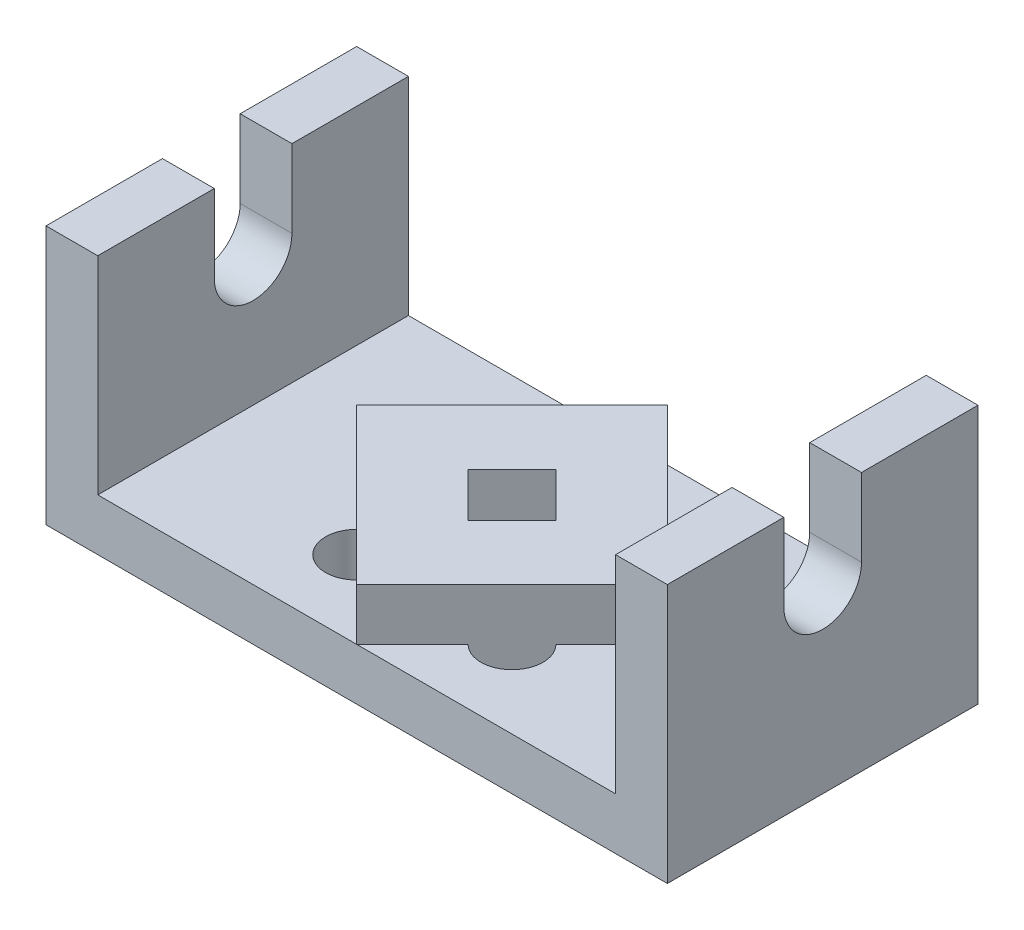
ISO-10303-21;
HEADER;
FILE_DESCRIPTION(('STEP AP214'),'2;1');
FILE_NAME('part.step','',(''),(''),'','','');
FILE_SCHEMA(('AUTOMOTIVE_DESIGN { 1 0 10303 214 1 1 1 1 }'));
ENDSEC;
DATA;
#1=APPLICATION_CONTEXT('core data for automotive mechanical design processes');
#2=APPLICATION_PROTOCOL_DEFINITION('international standard','automotive_design',2000,#1);
#3=PRODUCT_CONTEXT('',#1,'mechanical');
#4=PRODUCT('Part','Part','',(#3));
#5=PRODUCT_RELATED_PRODUCT_CATEGORY('part','',(#4));
#6=PRODUCT_DEFINITION_FORMATION('','',#4);
#7=PRODUCT_DEFINITION_CONTEXT('part definition',#1,'design');
#8=PRODUCT_DEFINITION('design','',#6,#7);
#9=PRODUCT_DEFINITION_SHAPE('','',#8);
#10=(LENGTH_UNIT() NAMED_UNIT(*) SI_UNIT(.MILLI.,.METRE.));
#11=(NAMED_UNIT(*) PLANE_ANGLE_UNIT() SI_UNIT($,.RADIAN.));
#12=(NAMED_UNIT(*) SI_UNIT($,.STERADIAN.) SOLID_ANGLE_UNIT());
#13=UNCERTAINTY_MEASURE_WITH_UNIT(LENGTH_MEASURE(1.E-05),#10,'distance_accuracy_value','');
#14=(GEOMETRIC_REPRESENTATION_CONTEXT(3) GLOBAL_UNCERTAINTY_ASSIGNED_CONTEXT((#13)) GLOBAL_UNIT_ASSIGNED_CONTEXT((#10,
#11,#12)) REPRESENTATION_CONTEXT('',''));
#15=CARTESIAN_POINT('',(0.,0.,0.));
#16=DIRECTION('',(0.,0.,1.));
#17=DIRECTION('',(1.,0.,0.));
#18=AXIS2_PLACEMENT_3D('',#15,#16,#17);
#19=CARTESIAN_POINT('',(50.,10.,30.));
#20=DIRECTION('',(0.,-1.,0.));
#21=DIRECTION('',(1.,0.,0.));
#22=AXIS2_PLACEMENT_3D('',#19,#20,#21);
#23=PLANE('',#22);
#24=DIRECTION('',(-0.707106781186548,0.,-0.707106781186547));
#25=VECTOR('',#24,1.);
#26=CARTESIAN_POINT('',(0.,10.,30.));
#27=LINE('',#26,#25);
#28=CARTESIAN_POINT('',(0.,10.,30.));
#29=VERTEX_POINT('',#28);
#30=CARTESIAN_POINT('',(-10.7573593128807,10.,19.2426406871193));
#31=VERTEX_POINT('',#30);
#32=EDGE_CURVE('E342',#29,#31,#27,.T.);
#33=ORIENTED_EDGE('',*,*,#32,.T.);
#34=CARTESIAN_POINT('',(-15.0000000000013,10.,15.0000000000012));
#35=DIRECTION('',(0.,-1.,0.));
#36=DIRECTION('',(1.,0.,0.));
#37=AXIS2_PLACEMENT_3D('',#34,#35,#36);
#38=CIRCLE('',#37,6.);
#39=CARTESIAN_POINT('',(-19.2426406871206,10.,10.7573593128819));
#40=VERTEX_POINT('',#39);
#41=EDGE_CURVE('E282',#31,#40,#38,.T.);
#42=ORIENTED_EDGE('',*,*,#41,.T.);
#43=CARTESIAN_POINT('',(-30.,10.,0.));
#44=VERTEX_POINT('',#43);
#45=EDGE_CURVE('E325',#40,#44,#27,.T.);
#46=ORIENTED_EDGE('',*,*,#45,.T.);
#47=DIRECTION('',(0.707106781186547,0.,-0.707106781186547));
#48=VECTOR('',#47,1.);
#49=CARTESIAN_POINT('',(-30.,10.,0.));
#50=LINE('',#49,#48);
#51=CARTESIAN_POINT('',(-19.2426406871199,10.,-10.7573593128801));
#52=VERTEX_POINT('',#51);
#53=EDGE_CURVE('E346',#44,#52,#50,.T.);
#54=ORIENTED_EDGE('',*,*,#53,.T.);
#55=CARTESIAN_POINT('',(-15.0000000000013,10.,-15.));
#56=DIRECTION('',(0.,-1.,0.));
#57=DIRECTION('',(1.,0.,0.));
#58=AXIS2_PLACEMENT_3D('',#55,#56,#57);
#59=CIRCLE('',#58,6.);
#60=CARTESIAN_POINT('',(-10.757359312882,10.,-19.2426406871193));
#61=VERTEX_POINT('',#60);
#62=EDGE_CURVE('E263',#52,#61,#59,.T.);
#63=ORIENTED_EDGE('',*,*,#62,.T.);
#64=CARTESIAN_POINT('',(0.,10.,-30.));
#65=VERTEX_POINT('',#64);
#66=EDGE_CURVE('E345',#61,#65,#50,.T.);
#67=ORIENTED_EDGE('',*,*,#66,.T.);
#68=DIRECTION('',(-1.,0.,0.));
#69=VECTOR('',#68,1.);
#70=CARTESIAN_POINT('',(50.,10.,-30.));
#71=LINE('',#70,#69);
#72=CARTESIAN_POINT('',(-50.,10.,-30.));
#73=VERTEX_POINT('',#72);
#74=EDGE_CURVE('E446',#65,#73,#71,.T.);
#75=ORIENTED_EDGE('',*,*,#74,.T.);
#76=DIRECTION('',(0.,0.,-1.));
#77=VECTOR('',#76,1.);
#78=CARTESIAN_POINT('',(-50.,10.,30.));
#79=LINE('',#78,#77);
#80=CARTESIAN_POINT('',(-50.,10.,30.));
#81=VERTEX_POINT('',#80);
#82=EDGE_CURVE('E428',#81,#73,#79,.T.);
#83=ORIENTED_EDGE('',*,*,#82,.F.);
#84=DIRECTION('',(-1.,0.,0.));
#85=VECTOR('',#84,1.);
#86=CARTESIAN_POINT('',(50.,10.,30.));
#87=LINE('',#86,#85);
#88=EDGE_CURVE('E424',#29,#81,#87,.T.);
#89=ORIENTED_EDGE('',*,*,#88,.F.);
#90=EDGE_LOOP('',(#33,#42,#46,#54,#63,#67,#75,#83,#89));
#91=FACE_BOUND('',#90,.T.);
#92=ADVANCED_FACE('F33',(#91),#23,.F.);
#93=CARTESIAN_POINT('',(-60.,50.,30.));
#94=DIRECTION('',(0.,-1.,0.));
#95=DIRECTION('',(0.,0.,-1.));
#96=AXIS2_PLACEMENT_3D('',#93,#94,#95);
#97=PLANE('',#96);
#98=DIRECTION('',(0.,0.,-1.));
#99=VECTOR('',#98,1.);
#100=CARTESIAN_POINT('',(-50.,50.,30.));
#101=LINE('',#100,#99);
#102=CARTESIAN_POINT('',(-50.,50.,30.));
#103=VERTEX_POINT('',#102);
#104=CARTESIAN_POINT('',(-50.,50.,7.5));
#105=VERTEX_POINT('',#104);
#106=EDGE_CURVE('E473',#103,#105,#101,.T.);
#107=ORIENTED_EDGE('',*,*,#106,.T.);
#108=DIRECTION('',(1.,0.,0.));
#109=VECTOR('',#108,1.);
#110=CARTESIAN_POINT('',(-60.,50.,7.5));
#111=LINE('',#110,#109);
#112=CARTESIAN_POINT('',(-60.,50.,7.5));
#113=VERTEX_POINT('',#112);
#114=EDGE_CURVE('E389',#113,#105,#111,.T.);
#115=ORIENTED_EDGE('',*,*,#114,.F.);
#116=DIRECTION('',(0.,0.,-1.));
#117=VECTOR('',#116,1.);
#118=CARTESIAN_POINT('',(-60.,50.,30.));
#119=LINE('',#118,#117);
#120=CARTESIAN_POINT('',(-60.,50.,30.));
#121=VERTEX_POINT('',#120);
#122=EDGE_CURVE('E469',#121,#113,#119,.T.);
#123=ORIENTED_EDGE('',*,*,#122,.F.);
#124=DIRECTION('',(-1.,0.,0.));
#125=VECTOR('',#124,1.);
#126=CARTESIAN_POINT('',(-60.,50.,30.));
#127=LINE('',#126,#125);
#128=EDGE_CURVE('E411',#103,#121,#127,.T.);
#129=ORIENTED_EDGE('',*,*,#128,.F.);
#130=EDGE_LOOP('',(#107,#115,#123,#129));
#131=FACE_BOUND('',#130,.T.);
#132=ADVANCED_FACE('F569',(#131),#97,.F.);
#133=CARTESIAN_POINT('',(60.,50.,30.));
#134=DIRECTION('',(0.,-1.,0.));
#135=DIRECTION('',(0.,0.,-1.));
#136=AXIS2_PLACEMENT_3D('',#133,#134,#135);
#137=PLANE('',#136);
#138=DIRECTION('',(0.,0.,-1.));
#139=VECTOR('',#138,1.);
#140=CARTESIAN_POINT('',(60.,50.,30.));
#141=LINE('',#140,#139);
#142=CARTESIAN_POINT('',(60.,50.,30.));
#143=VERTEX_POINT('',#142);
#144=CARTESIAN_POINT('',(60.,50.,7.5));
#145=VERTEX_POINT('',#144);
#146=EDGE_CURVE('E459',#143,#145,#141,.T.);
#147=ORIENTED_EDGE('',*,*,#146,.T.);
#148=CARTESIAN_POINT('',(50.,50.,7.5));
#149=VERTEX_POINT('',#148);
#150=EDGE_CURVE('E391',#149,#145,#111,.T.);
#151=ORIENTED_EDGE('',*,*,#150,.F.);
#152=DIRECTION('',(0.,0.,-1.));
#153=VECTOR('',#152,1.);
#154=CARTESIAN_POINT('',(50.,50.,30.));
#155=LINE('',#154,#153);
#156=CARTESIAN_POINT('',(50.,50.,30.));
#157=VERTEX_POINT('',#156);
#158=EDGE_CURVE('E455',#157,#149,#155,.T.);
#159=ORIENTED_EDGE('',*,*,#158,.F.);
#160=DIRECTION('',(-1.,0.,0.));
#161=VECTOR('',#160,1.);
#162=CARTESIAN_POINT('',(60.,50.,30.));
#163=LINE('',#162,#161);
#164=EDGE_CURVE('E420',#143,#157,#163,.T.);
#165=ORIENTED_EDGE('',*,*,#164,.F.);
#166=EDGE_LOOP('',(#147,#151,#159,#165));
#167=FACE_BOUND('',#166,.T.);
#168=ADVANCED_FACE('F571',(#167),#137,.F.);
#169=CARTESIAN_POINT('',(-50.,50.,30.));
#170=DIRECTION('',(-1.,0.,0.));
#171=DIRECTION('',(0.,-1.,0.));
#172=AXIS2_PLACEMENT_3D('',#169,#170,#171);
#173=PLANE('',#172);
#174=CARTESIAN_POINT('',(-50.,35.,0.));
#175=DIRECTION('',(-1.,0.,0.));
#176=DIRECTION('',(0.,-1.,0.));
#177=AXIS2_PLACEMENT_3D('',#174,#175,#176);
#178=CIRCLE('',#177,7.5);
#179=CARTESIAN_POINT('',(-50.,35.,-7.5));
#180=VERTEX_POINT('',#179);
#181=CARTESIAN_POINT('',(-50.,35.,7.5));
#182=VERTEX_POINT('',#181);
#183=EDGE_CURVE('E404',#180,#182,#178,.T.);
#184=ORIENTED_EDGE('',*,*,#183,.T.);
#185=DIRECTION('',(0.,1.,0.));
#186=VECTOR('',#185,1.);
#187=CARTESIAN_POINT('',(-50.,50.,7.5));
#188=LINE('',#187,#186);
#189=EDGE_CURVE('E401',#182,#105,#188,.T.);
#190=ORIENTED_EDGE('',*,*,#189,.T.);
#191=ORIENTED_EDGE('',*,*,#106,.F.);
#192=DIRECTION('',(0.,1.,0.));
#193=VECTOR('',#192,1.);
#194=CARTESIAN_POINT('',(-50.,50.,30.));
#195=LINE('',#194,#193);
#196=EDGE_CURVE('E408',#81,#103,#195,.T.);
#197=ORIENTED_EDGE('',*,*,#196,.F.);
#198=ORIENTED_EDGE('',*,*,#82,.T.);
#199=DIRECTION('',(0.,1.,0.));
#200=VECTOR('',#199,1.);
#201=CARTESIAN_POINT('',(-50.,50.,-30.));
#202=LINE('',#201,#200);
#203=CARTESIAN_POINT('',(-50.,50.,-30.));
#204=VERTEX_POINT('',#203);
#205=EDGE_CURVE('E407',#73,#204,#202,.T.);
#206=ORIENTED_EDGE('',*,*,#205,.T.);
#207=CARTESIAN_POINT('',(-50.,50.,-7.5));
#208=VERTEX_POINT('',#207);
#209=EDGE_CURVE('E472',#208,#204,#101,.T.);
#210=ORIENTED_EDGE('',*,*,#209,.F.);
#211=DIRECTION('',(0.,-1.,0.));
#212=VECTOR('',#211,1.);
#213=CARTESIAN_POINT('',(-50.,50.,-7.5));
#214=LINE('',#213,#212);
#215=EDGE_CURVE('E387',#208,#180,#214,.T.);
#216=ORIENTED_EDGE('',*,*,#215,.T.);
#217=EDGE_LOOP('',(#184,#190,#191,#197,#198,#206,#210,#216));
#218=FACE_BOUND('',#217,.T.);
#219=ADVANCED_FACE('F35',(#218),#173,.F.);
#220=CARTESIAN_POINT('',(-60.,50.,-7.5));
#221=VERTEX_POINT('',#220);
#222=CARTESIAN_POINT('',(-60.,50.,-30.));
#223=VERTEX_POINT('',#222);
#224=EDGE_CURVE('E468',#221,#223,#119,.T.);
#225=ORIENTED_EDGE('',*,*,#224,.F.);
#226=DIRECTION('',(1.,0.,0.));
#227=VECTOR('',#226,1.);
#228=CARTESIAN_POINT('',(-60.,50.,-7.5));
#229=LINE('',#228,#227);
#230=EDGE_CURVE('E392',#221,#208,#229,.T.);
#231=ORIENTED_EDGE('',*,*,#230,.T.);
#232=ORIENTED_EDGE('',*,*,#209,.T.);
#233=DIRECTION('',(-1.,0.,0.));
#234=VECTOR('',#233,1.);
#235=CARTESIAN_POINT('',(-60.,50.,-30.));
#236=LINE('',#235,#234);
#237=EDGE_CURVE('E431',#204,#223,#236,.T.);
#238=ORIENTED_EDGE('',*,*,#237,.T.);
#239=EDGE_LOOP('',(#225,#231,#232,#238));
#240=FACE_BOUND('',#239,.T.);
#241=ADVANCED_FACE('F558',(#240),#97,.F.);
#242=CARTESIAN_POINT('',(-60.,0.,30.));
#243=DIRECTION('',(1.,0.,0.));
#244=DIRECTION('',(0.,0.,-1.));
#245=AXIS2_PLACEMENT_3D('',#242,#243,#244);
#246=PLANE('',#245);
#247=ORIENTED_EDGE('',*,*,#122,.T.);
#248=DIRECTION('',(0.,-1.,0.));
#249=VECTOR('',#248,1.);
#250=CARTESIAN_POINT('',(-60.,35.,7.5));
#251=LINE('',#250,#249);
#252=CARTESIAN_POINT('',(-60.,35.,7.5));
#253=VERTEX_POINT('',#252);
#254=EDGE_CURVE('E374',#113,#253,#251,.T.);
#255=ORIENTED_EDGE('',*,*,#254,.T.);
#256=CARTESIAN_POINT('',(-60.,35.,0.));
#257=DIRECTION('',(1.,0.,0.));
#258=DIRECTION('',(0.,0.,-1.));
#259=AXIS2_PLACEMENT_3D('',#256,#257,#258);
#260=CIRCLE('',#259,7.5);
#261=CARTESIAN_POINT('',(-60.,35.,-7.5));
#262=VERTEX_POINT('',#261);
#263=EDGE_CURVE('E367',#253,#262,#260,.T.);
#264=ORIENTED_EDGE('',*,*,#263,.T.);
#265=DIRECTION('',(0.,1.,0.));
#266=VECTOR('',#265,1.);
#267=CARTESIAN_POINT('',(-60.,35.,-7.5));
#268=LINE('',#267,#266);
#269=EDGE_CURVE('E370',#262,#221,#268,.T.);
#270=ORIENTED_EDGE('',*,*,#269,.T.);
#271=ORIENTED_EDGE('',*,*,#224,.T.);
#272=DIRECTION('',(0.,-1.,0.));
#273=VECTOR('',#272,1.);
#274=CARTESIAN_POINT('',(-60.,0.,-30.));
#275=LINE('',#274,#273);
#276=CARTESIAN_POINT('',(-60.,0.,-30.));
#277=VERTEX_POINT('',#276);
#278=EDGE_CURVE('E434',#223,#277,#275,.T.);
#279=ORIENTED_EDGE('',*,*,#278,.T.);
#280=DIRECTION('',(0.,0.,-1.));
#281=VECTOR('',#280,1.);
#282=CARTESIAN_POINT('',(-60.,0.,30.));
#283=LINE('',#282,#281);
#284=CARTESIAN_POINT('',(-60.,0.,30.));
#285=VERTEX_POINT('',#284);
#286=EDGE_CURVE('E465',#285,#277,#283,.T.);
#287=ORIENTED_EDGE('',*,*,#286,.F.);
#288=DIRECTION('',(0.,-1.,0.));
#289=VECTOR('',#288,1.);
#290=CARTESIAN_POINT('',(-60.,0.,30.));
#291=LINE('',#290,#289);
#292=EDGE_CURVE('E414',#121,#285,#291,.T.);
#293=ORIENTED_EDGE('',*,*,#292,.F.);
#294=EDGE_LOOP('',(#247,#255,#264,#270,#271,#279,#287,#293));
#295=FACE_BOUND('',#294,.T.);
#296=ADVANCED_FACE('F537',(#295),#246,.F.);
#297=CARTESIAN_POINT('',(-60.,0.,30.));
#298=DIRECTION('',(0.,1.,0.));
#299=DIRECTION('',(-1.,0.,0.));
#300=AXIS2_PLACEMENT_3D('',#297,#298,#299);
#301=PLANE('',#300);
#302=DIRECTION('',(-0.707106781186547,0.,0.707106781186548));
#303=VECTOR('',#302,1.);
#304=CARTESIAN_POINT('',(19.2426406871193,0.,10.757359312882));
#305=LINE('',#304,#303);
#306=CARTESIAN_POINT('',(19.2426406871193,0.,10.757359312882));
#307=VERTEX_POINT('',#306);
#308=CARTESIAN_POINT('',(10.7573593128807,0.,19.2426406871205));
#309=VERTEX_POINT('',#308);
#310=EDGE_CURVE('E249',#307,#309,#305,.T.);
#311=ORIENTED_EDGE('',*,*,#310,.T.);
#312=CARTESIAN_POINT('',(15.,0.,15.0000000000013));
#313=DIRECTION('',(0.,1.,0.));
#314=DIRECTION('',(-1.,0.,0.));
#315=AXIS2_PLACEMENT_3D('',#312,#313,#314);
#316=CIRCLE('',#315,6.);
#317=EDGE_CURVE('E48',#309,#307,#316,.T.);
#318=ORIENTED_EDGE('',*,*,#317,.T.);
#319=EDGE_LOOP('',(#311,#318));
#320=FACE_BOUND('',#319,.T.);
#321=DIRECTION('',(-0.707106781186548,0.,-0.707106781186547));
#322=VECTOR('',#321,1.);
#323=CARTESIAN_POINT('',(-10.757359312882,0.,19.2426406871205));
#324=LINE('',#323,#322);
#325=CARTESIAN_POINT('',(-10.757359312882,0.,19.2426406871205));
#326=VERTEX_POINT('',#325);
#327=CARTESIAN_POINT('',(-19.2426406871206,0.,10.7573593128819));
#328=VERTEX_POINT('',#327);
#329=EDGE_CURVE('E266',#326,#328,#324,.T.);
#330=ORIENTED_EDGE('',*,*,#329,.T.);
#331=CARTESIAN_POINT('',(-15.0000000000013,0.,15.0000000000012));
#332=DIRECTION('',(0.,1.,0.));
#333=DIRECTION('',(-1.,0.,0.));
#334=AXIS2_PLACEMENT_3D('',#331,#332,#333);
#335=CIRCLE('',#334,6.);
#336=EDGE_CURVE('E56',#328,#326,#335,.T.);
#337=ORIENTED_EDGE('',*,*,#336,.T.);
#338=EDGE_LOOP('',(#330,#337));
#339=FACE_BOUND('',#338,.T.);
#340=DIRECTION('',(0.707106781186547,0.,-0.707106781186548));
#341=VECTOR('',#340,1.);
#342=CARTESIAN_POINT('',(-19.2426406871205,0.,-10.7573593128807));
#343=LINE('',#342,#341);
#344=CARTESIAN_POINT('',(-19.2426406871205,0.,-10.7573593128807));
#345=VERTEX_POINT('',#344);
#346=CARTESIAN_POINT('',(-10.757359312882,0.,-19.2426406871193));
#347=VERTEX_POINT('',#346);
#348=EDGE_CURVE('E274',#345,#347,#343,.T.);
#349=ORIENTED_EDGE('',*,*,#348,.T.);
#350=CARTESIAN_POINT('',(-15.0000000000013,0.,-15.));
#351=DIRECTION('',(0.,1.,0.));
#352=DIRECTION('',(-1.,0.,0.));
#353=AXIS2_PLACEMENT_3D('',#350,#351,#352);
#354=CIRCLE('',#353,6.);
#355=EDGE_CURVE('E271',#347,#345,#354,.T.);
#356=ORIENTED_EDGE('',*,*,#355,.T.);
#357=EDGE_LOOP('',(#349,#356));
#358=FACE_BOUND('',#357,.T.);
#359=DIRECTION('',(0.707106781186547,0.,0.707106781186547));
#360=VECTOR('',#359,1.);
#361=CARTESIAN_POINT('',(10.7573593128807,0.,-19.2426406871193));
#362=LINE('',#361,#360);
#363=CARTESIAN_POINT('',(10.7573593128807,0.,-19.2426406871193));
#364=VERTEX_POINT('',#363);
#365=CARTESIAN_POINT('',(19.2426406871193,0.,-10.7573593128807));
#366=VERTEX_POINT('',#365);
#367=EDGE_CURVE('E289',#364,#366,#362,.T.);
#368=ORIENTED_EDGE('',*,*,#367,.T.);
#369=CARTESIAN_POINT('',(15.,0.,-15.));
#370=DIRECTION('',(0.,1.,0.));
#371=DIRECTION('',(-1.,0.,0.));
#372=AXIS2_PLACEMENT_3D('',#369,#370,#371);
#373=CIRCLE('',#372,6.);
#374=EDGE_CURVE('E286',#366,#364,#373,.T.);
#375=ORIENTED_EDGE('',*,*,#374,.T.);
#376=EDGE_LOOP('',(#368,#375));
#377=FACE_BOUND('',#376,.T.);
#378=DIRECTION('',(-0.707106781186547,0.,-0.707106781186548));
#379=VECTOR('',#378,1.);
#380=CARTESIAN_POINT('',(0.,0.,-8.48528137423857));
#381=LINE('',#380,#379);
#382=CARTESIAN_POINT('',(8.48528137423857,0.,0.));
#383=VERTEX_POINT('',#382);
#384=CARTESIAN_POINT('',(0.,0.,-8.48528137423857));
#385=VERTEX_POINT('',#384);
#386=EDGE_CURVE('E310',#383,#385,#381,.T.);
#387=ORIENTED_EDGE('',*,*,#386,.T.);
#388=DIRECTION('',(-0.707106781186548,0.,0.707106781186547));
#389=VECTOR('',#388,1.);
#390=CARTESIAN_POINT('',(-8.48528137423857,0.,0.));
#391=LINE('',#390,#389);
#392=CARTESIAN_POINT('',(-8.48528137423857,0.,0.));
#393=VERTEX_POINT('',#392);
#394=EDGE_CURVE('E300',#385,#393,#391,.T.);
#395=ORIENTED_EDGE('',*,*,#394,.T.);
#396=DIRECTION('',(0.707106781186547,0.,0.707106781186548));
#397=VECTOR('',#396,1.);
#398=CARTESIAN_POINT('',(0.,0.,8.48528137423857));
#399=LINE('',#398,#397);
#400=CARTESIAN_POINT('',(0.,0.,8.48528137423857));
#401=VERTEX_POINT('',#400);
#402=EDGE_CURVE('E303',#393,#401,#399,.T.);
#403=ORIENTED_EDGE('',*,*,#402,.T.);
#404=DIRECTION('',(0.707106781186548,0.,-0.707106781186547));
#405=VECTOR('',#404,1.);
#406=CARTESIAN_POINT('',(8.48528137423857,0.,0.));
#407=LINE('',#406,#405);
#408=EDGE_CURVE('E307',#401,#383,#407,.T.);
#409=ORIENTED_EDGE('',*,*,#408,.T.);
#410=EDGE_LOOP('',(#387,#395,#403,#409));
#411=FACE_BOUND('',#410,.T.);
#412=DIRECTION('',(1.,0.,0.));
#413=VECTOR('',#412,1.);
#414=CARTESIAN_POINT('',(-60.,0.,-30.));
#415=LINE('',#414,#413);
#416=CARTESIAN_POINT('',(60.,0.,-30.));
#417=VERTEX_POINT('',#416);
#418=EDGE_CURVE('E436',#277,#417,#415,.T.);
#419=ORIENTED_EDGE('',*,*,#418,.T.);
#420=DIRECTION('',(0.,0.,-1.));
#421=VECTOR('',#420,1.);
#422=CARTESIAN_POINT('',(60.,0.,30.));
#423=LINE('',#422,#421);
#424=CARTESIAN_POINT('',(60.,0.,30.));
#425=VERTEX_POINT('',#424);
#426=EDGE_CURVE('E462',#425,#417,#423,.T.);
#427=ORIENTED_EDGE('',*,*,#426,.F.);
#428=DIRECTION('',(1.,0.,0.));
#429=VECTOR('',#428,1.);
#430=CARTESIAN_POINT('',(-60.,0.,30.));
#431=LINE('',#430,#429);
#432=EDGE_CURVE('E416',#285,#425,#431,.T.);
#433=ORIENTED_EDGE('',*,*,#432,.F.);
#434=ORIENTED_EDGE('',*,*,#286,.T.);
#435=EDGE_LOOP('',(#419,#427,#433,#434));
#436=FACE_BOUND('',#435,.T.);
#437=ADVANCED_FACE('F256',(#320,#339,#358,#377,#411,#436),#301,.F.);
#438=CARTESIAN_POINT('',(60.,0.,30.));
#439=DIRECTION('',(-1.,0.,0.));
#440=DIRECTION('',(0.,0.,1.));
#441=AXIS2_PLACEMENT_3D('',#438,#439,#440);
#442=PLANE('',#441);
#443=CARTESIAN_POINT('',(60.,35.,0.));
#444=DIRECTION('',(1.,0.,0.));
#445=DIRECTION('',(0.,0.,-1.));
#446=AXIS2_PLACEMENT_3D('',#443,#444,#445);
#447=CIRCLE('',#446,7.5);
#448=CARTESIAN_POINT('',(60.,35.,7.5));
#449=VERTEX_POINT('',#448);
#450=CARTESIAN_POINT('',(60.,35.,-7.5));
#451=VERTEX_POINT('',#450);
#452=EDGE_CURVE('E358',#449,#451,#447,.T.);
#453=ORIENTED_EDGE('',*,*,#452,.F.);
#454=DIRECTION('',(0.,-1.,0.));
#455=VECTOR('',#454,1.);
#456=CARTESIAN_POINT('',(60.,35.,7.5));
#457=LINE('',#456,#455);
#458=EDGE_CURVE('E371',#145,#449,#457,.T.);
#459=ORIENTED_EDGE('',*,*,#458,.F.);
#460=ORIENTED_EDGE('',*,*,#146,.F.);
#461=DIRECTION('',(0.,1.,0.));
#462=VECTOR('',#461,1.);
#463=CARTESIAN_POINT('',(60.,0.,30.));
#464=LINE('',#463,#462);
#465=EDGE_CURVE('E418',#425,#143,#464,.T.);
#466=ORIENTED_EDGE('',*,*,#465,.F.);
#467=ORIENTED_EDGE('',*,*,#426,.T.);
#468=DIRECTION('',(0.,1.,0.));
#469=VECTOR('',#468,1.);
#470=CARTESIAN_POINT('',(60.,0.,-30.));
#471=LINE('',#470,#469);
#472=CARTESIAN_POINT('',(60.,50.,-30.));
#473=VERTEX_POINT('',#472);
#474=EDGE_CURVE('E438',#417,#473,#471,.T.);
#475=ORIENTED_EDGE('',*,*,#474,.T.);
#476=CARTESIAN_POINT('',(60.,50.,-7.5));
#477=VERTEX_POINT('',#476);
#478=EDGE_CURVE('E458',#477,#473,#141,.T.);
#479=ORIENTED_EDGE('',*,*,#478,.F.);
#480=DIRECTION('',(0.,1.,0.));
#481=VECTOR('',#480,1.);
#482=CARTESIAN_POINT('',(60.,35.,-7.5));
#483=LINE('',#482,#481);
#484=EDGE_CURVE('E380',#451,#477,#483,.T.);
#485=ORIENTED_EDGE('',*,*,#484,.F.);
#486=EDGE_LOOP('',(#453,#459,#460,#466,#467,#475,#479,#485));
#487=FACE_BOUND('',#486,.T.);
#488=ADVANCED_FACE('F494',(#487),#442,.F.);
#489=CARTESIAN_POINT('',(50.,50.,-7.5));
#490=VERTEX_POINT('',#489);
#491=CARTESIAN_POINT('',(50.,50.,-30.));
#492=VERTEX_POINT('',#491);
#493=EDGE_CURVE('E454',#490,#492,#155,.T.);
#494=ORIENTED_EDGE('',*,*,#493,.F.);
#495=EDGE_CURVE('E395',#490,#477,#229,.T.);
#496=ORIENTED_EDGE('',*,*,#495,.T.);
#497=ORIENTED_EDGE('',*,*,#478,.T.);
#498=DIRECTION('',(-1.,0.,0.));
#499=VECTOR('',#498,1.);
#500=CARTESIAN_POINT('',(60.,50.,-30.));
#501=LINE('',#500,#499);
#502=EDGE_CURVE('E441',#473,#492,#501,.T.);
#503=ORIENTED_EDGE('',*,*,#502,.T.);
#504=EDGE_LOOP('',(#494,#496,#497,#503));
#505=FACE_BOUND('',#504,.T.);
#506=ADVANCED_FACE('F500',(#505),#137,.F.);
#507=CARTESIAN_POINT('',(50.,50.,30.));
#508=DIRECTION('',(1.,0.,0.));
#509=DIRECTION('',(0.,1.,0.));
#510=AXIS2_PLACEMENT_3D('',#507,#508,#509);
#511=PLANE('',#510);
#512=ORIENTED_EDGE('',*,*,#158,.T.);
#513=DIRECTION('',(0.,-1.,0.));
#514=VECTOR('',#513,1.);
#515=CARTESIAN_POINT('',(50.,50.,7.5));
#516=LINE('',#515,#514);
#517=CARTESIAN_POINT('',(50.,35.,7.5));
#518=VERTEX_POINT('',#517);
#519=EDGE_CURVE('E11',#149,#518,#516,.T.);
#520=ORIENTED_EDGE('',*,*,#519,.T.);
#521=CARTESIAN_POINT('',(50.,35.,0.));
#522=DIRECTION('',(1.,0.,0.));
#523=DIRECTION('',(0.,1.,0.));
#524=AXIS2_PLACEMENT_3D('',#521,#522,#523);
#525=CIRCLE('',#524,7.5);
#526=CARTESIAN_POINT('',(50.,35.,-7.5));
#527=VERTEX_POINT('',#526);
#528=EDGE_CURVE('E41',#518,#527,#525,.T.);
#529=ORIENTED_EDGE('',*,*,#528,.T.);
#530=DIRECTION('',(0.,1.,0.));
#531=VECTOR('',#530,1.);
#532=CARTESIAN_POINT('',(50.,50.,-7.5));
#533=LINE('',#532,#531);
#534=EDGE_CURVE('E476',#527,#490,#533,.T.);
#535=ORIENTED_EDGE('',*,*,#534,.T.);
#536=ORIENTED_EDGE('',*,*,#493,.T.);
#537=DIRECTION('',(0.,-1.,0.));
#538=VECTOR('',#537,1.);
#539=CARTESIAN_POINT('',(50.,50.,-30.));
#540=LINE('',#539,#538);
#541=CARTESIAN_POINT('',(50.,10.,-30.));
#542=VERTEX_POINT('',#541);
#543=EDGE_CURVE('E444',#492,#542,#540,.T.);
#544=ORIENTED_EDGE('',*,*,#543,.T.);
#545=DIRECTION('',(0.,0.,-1.));
#546=VECTOR('',#545,1.);
#547=CARTESIAN_POINT('',(50.,10.,30.));
#548=LINE('',#547,#546);
#549=CARTESIAN_POINT('',(50.,10.,30.));
#550=VERTEX_POINT('',#549);
#551=EDGE_CURVE('E451',#550,#542,#548,.T.);
#552=ORIENTED_EDGE('',*,*,#551,.F.);
#553=DIRECTION('',(0.,-1.,0.));
#554=VECTOR('',#553,1.);
#555=CARTESIAN_POINT('',(50.,50.,30.));
#556=LINE('',#555,#554);
#557=EDGE_CURVE('E422',#157,#550,#556,.T.);
#558=ORIENTED_EDGE('',*,*,#557,.F.);
#559=EDGE_LOOP('',(#512,#520,#529,#535,#536,#544,#552,#558));
#560=FACE_BOUND('',#559,.T.);
#561=ADVANCED_FACE('F480',(#560),#511,.F.);
#562=DIRECTION('',(-0.707106781186547,0.,0.707106781186548));
#563=VECTOR('',#562,1.);
#564=CARTESIAN_POINT('',(30.,10.,0.));
#565=LINE('',#564,#563);
#566=CARTESIAN_POINT('',(30.,10.,0.));
#567=VERTEX_POINT('',#566);
#568=CARTESIAN_POINT('',(19.2426406871187,10.,10.7573593128814));
#569=VERTEX_POINT('',#568);
#570=EDGE_CURVE('E335',#567,#569,#565,.T.);
#571=ORIENTED_EDGE('',*,*,#570,.T.);
#572=CARTESIAN_POINT('',(15.,10.,15.0000000000013));
#573=DIRECTION('',(0.,-1.,0.));
#574=DIRECTION('',(1.,0.,0.));
#575=AXIS2_PLACEMENT_3D('',#572,#573,#574);
#576=CIRCLE('',#575,6.);
#577=CARTESIAN_POINT('',(10.7573593128807,10.,19.2426406871205));
#578=VERTEX_POINT('',#577);
#579=EDGE_CURVE('E244',#569,#578,#576,.T.);
#580=ORIENTED_EDGE('',*,*,#579,.T.);
#581=EDGE_CURVE('E353',#578,#29,#565,.T.);
#582=ORIENTED_EDGE('',*,*,#581,.T.);
#583=EDGE_CURVE('E425',#550,#29,#87,.T.);
#584=ORIENTED_EDGE('',*,*,#583,.F.);
#585=ORIENTED_EDGE('',*,*,#551,.T.);
#586=EDGE_CURVE('E412',#542,#65,#71,.T.);
#587=ORIENTED_EDGE('',*,*,#586,.T.);
#588=DIRECTION('',(0.707106781186547,0.,0.707106781186547));
#589=VECTOR('',#588,1.);
#590=CARTESIAN_POINT('',(0.,10.,-30.));
#591=LINE('',#590,#589);
#592=CARTESIAN_POINT('',(10.7573593128807,10.,-19.2426406871193));
#593=VERTEX_POINT('',#592);
#594=EDGE_CURVE('E350',#65,#593,#591,.T.);
#595=ORIENTED_EDGE('',*,*,#594,.T.);
#596=CARTESIAN_POINT('',(15.,10.,-15.));
#597=DIRECTION('',(0.,-1.,0.));
#598=DIRECTION('',(1.,0.,0.));
#599=AXIS2_PLACEMENT_3D('',#596,#597,#598);
#600=CIRCLE('',#599,6.);
#601=CARTESIAN_POINT('',(19.2426406871193,10.,-10.7573593128807));
#602=VERTEX_POINT('',#601);
#603=EDGE_CURVE('E295',#593,#602,#600,.T.);
#604=ORIENTED_EDGE('',*,*,#603,.T.);
#605=EDGE_CURVE('E349',#602,#567,#591,.T.);
#606=ORIENTED_EDGE('',*,*,#605,.T.);
#607=EDGE_LOOP('',(#571,#580,#582,#584,#585,#587,#595,#604,#606));
#608=FACE_BOUND('',#607,.T.);
#609=ADVANCED_FACE('F509',(#608),#23,.F.);
#610=CARTESIAN_POINT('',(0.,0.,30.));
#611=DIRECTION('',(0.,0.,-1.));
#612=DIRECTION('',(-1.,0.,0.));
#613=AXIS2_PLACEMENT_3D('',#610,#611,#612);
#614=PLANE('',#613);
#615=ORIENTED_EDGE('',*,*,#196,.T.);
#616=ORIENTED_EDGE('',*,*,#128,.T.);
#617=ORIENTED_EDGE('',*,*,#292,.T.);
#618=ORIENTED_EDGE('',*,*,#432,.T.);
#619=ORIENTED_EDGE('',*,*,#465,.T.);
#620=ORIENTED_EDGE('',*,*,#164,.T.);
#621=ORIENTED_EDGE('',*,*,#557,.T.);
#622=ORIENTED_EDGE('',*,*,#583,.T.);
#623=ORIENTED_EDGE('',*,*,#88,.T.);
#624=EDGE_LOOP('',(#615,#616,#617,#618,#619,#620,#621,#622,#623));
#625=FACE_BOUND('',#624,.T.);
#626=ADVANCED_FACE('F524',(#625),#614,.F.);
#627=CARTESIAN_POINT('',(0.,0.,-30.));
#628=DIRECTION('',(0.,0.,-1.));
#629=DIRECTION('',(-1.,0.,0.));
#630=AXIS2_PLACEMENT_3D('',#627,#628,#629);
#631=PLANE('',#630);
#632=ORIENTED_EDGE('',*,*,#205,.F.);
#633=ORIENTED_EDGE('',*,*,#74,.F.);
#634=ORIENTED_EDGE('',*,*,#586,.F.);
#635=ORIENTED_EDGE('',*,*,#543,.F.);
#636=ORIENTED_EDGE('',*,*,#502,.F.);
#637=ORIENTED_EDGE('',*,*,#474,.F.);
#638=ORIENTED_EDGE('',*,*,#418,.F.);
#639=ORIENTED_EDGE('',*,*,#278,.F.);
#640=ORIENTED_EDGE('',*,*,#237,.F.);
#641=EDGE_LOOP('',(#632,#633,#634,#635,#636,#637,#638,#639,#640));
#642=FACE_BOUND('',#641,.T.);
#643=ADVANCED_FACE('F512',(#642),#631,.T.);
#644=CARTESIAN_POINT('',(-60.,35.,-7.5));
#645=DIRECTION('',(0.,0.,-1.));
#646=DIRECTION('',(-1.,0.,0.));
#647=AXIS2_PLACEMENT_3D('',#644,#645,#646);
#648=PLANE('',#647);
#649=DIRECTION('',(1.,0.,0.));
#650=VECTOR('',#649,1.);
#651=CARTESIAN_POINT('',(-60.,35.,-7.5));
#652=LINE('',#651,#650);
#653=EDGE_CURVE('E377',#527,#451,#652,.T.);
#654=ORIENTED_EDGE('',*,*,#653,.T.);
#655=ORIENTED_EDGE('',*,*,#484,.T.);
#656=ORIENTED_EDGE('',*,*,#495,.F.);
#657=ORIENTED_EDGE('',*,*,#534,.F.);
#658=EDGE_LOOP('',(#654,#655,#656,#657));
#659=FACE_BOUND('',#658,.T.);
#660=ADVANCED_FACE('F498',(#659),#648,.F.);
#661=CARTESIAN_POINT('',(-60.,35.,7.5));
#662=DIRECTION('',(0.,0.,1.));
#663=DIRECTION('',(1.,0.,0.));
#664=AXIS2_PLACEMENT_3D('',#661,#662,#663);
#665=PLANE('',#664);
#666=ORIENTED_EDGE('',*,*,#150,.T.);
#667=ORIENTED_EDGE('',*,*,#458,.T.);
#668=DIRECTION('',(1.,0.,0.));
#669=VECTOR('',#668,1.);
#670=CARTESIAN_POINT('',(-60.,35.,7.5));
#671=LINE('',#670,#669);
#672=EDGE_CURVE('E388',#518,#449,#671,.T.);
#673=ORIENTED_EDGE('',*,*,#672,.F.);
#674=ORIENTED_EDGE('',*,*,#519,.F.);
#675=EDGE_LOOP('',(#666,#667,#673,#674));
#676=FACE_BOUND('',#675,.T.);
#677=ADVANCED_FACE('F487',(#676),#665,.F.);
#678=CARTESIAN_POINT('',(-60.,35.,0.));
#679=DIRECTION('',(1.,0.,0.));
#680=DIRECTION('',(0.,0.,-1.));
#681=AXIS2_PLACEMENT_3D('',#678,#679,#680);
#682=CYLINDRICAL_SURFACE('',#681,7.5);
#683=ORIENTED_EDGE('',*,*,#672,.T.);
#684=ORIENTED_EDGE('',*,*,#452,.T.);
#685=ORIENTED_EDGE('',*,*,#653,.F.);
#686=ORIENTED_EDGE('',*,*,#528,.F.);
#687=EDGE_LOOP('',(#683,#684,#685,#686));
#688=FACE_BOUND('',#687,.T.);
#689=ADVANCED_FACE('F485',(#688),#682,.F.);
#690=EDGE_CURVE('E396',#262,#180,#652,.T.);
#691=ORIENTED_EDGE('',*,*,#690,.F.);
#692=ORIENTED_EDGE('',*,*,#263,.F.);
#693=EDGE_CURVE('E384',#253,#182,#671,.T.);
#694=ORIENTED_EDGE('',*,*,#693,.T.);
#695=ORIENTED_EDGE('',*,*,#183,.F.);
#696=EDGE_LOOP('',(#691,#692,#694,#695));
#697=FACE_BOUND('',#696,.T.);
#698=ADVANCED_FACE('F564',(#697),#682,.F.);
#699=ORIENTED_EDGE('',*,*,#693,.F.);
#700=ORIENTED_EDGE('',*,*,#254,.F.);
#701=ORIENTED_EDGE('',*,*,#114,.T.);
#702=ORIENTED_EDGE('',*,*,#189,.F.);
#703=EDGE_LOOP('',(#699,#700,#701,#702));
#704=FACE_BOUND('',#703,.T.);
#705=ADVANCED_FACE('F566',(#704),#665,.F.);
#706=ORIENTED_EDGE('',*,*,#230,.F.);
#707=ORIENTED_EDGE('',*,*,#269,.F.);
#708=ORIENTED_EDGE('',*,*,#690,.T.);
#709=ORIENTED_EDGE('',*,*,#215,.F.);
#710=EDGE_LOOP('',(#706,#707,#708,#709));
#711=FACE_BOUND('',#710,.T.);
#712=ADVANCED_FACE('F560',(#711),#648,.F.);
#713=CARTESIAN_POINT('',(0.,20.,30.));
#714=DIRECTION('',(-0.707106781186547,0.,0.707106781186548));
#715=DIRECTION('',(0.707106781186548,0.,0.707106781186547));
#716=AXIS2_PLACEMENT_3D('',#713,#714,#715);
#717=PLANE('',#716);
#718=ORIENTED_EDGE('',*,*,#45,.F.);
#719=DIRECTION('',(0.,1.,0.));
#720=VECTOR('',#719,1.);
#721=CARTESIAN_POINT('',(-19.2426406871206,0.,10.7573593128819));
#722=LINE('',#721,#720);
#723=EDGE_CURVE('E258',#328,#40,#722,.T.);
#724=ORIENTED_EDGE('',*,*,#723,.F.);
#725=ORIENTED_EDGE('',*,*,#329,.F.);
#726=DIRECTION('',(0.,1.,0.));
#727=VECTOR('',#726,1.);
#728=CARTESIAN_POINT('',(-10.757359312882,0.,19.2426406871205));
#729=LINE('',#728,#727);
#730=EDGE_CURVE('E260',#326,#31,#729,.T.);
#731=ORIENTED_EDGE('',*,*,#730,.T.);
#732=ORIENTED_EDGE('',*,*,#32,.F.);
#733=DIRECTION('',(0.,-1.,0.));
#734=VECTOR('',#733,1.);
#735=CARTESIAN_POINT('',(0.,20.,30.));
#736=LINE('',#735,#734);
#737=CARTESIAN_POINT('',(0.,20.,30.));
#738=VERTEX_POINT('',#737);
#739=EDGE_CURVE('E355',#738,#29,#736,.T.);
#740=ORIENTED_EDGE('',*,*,#739,.F.);
#741=DIRECTION('',(-0.707106781186548,0.,-0.707106781186547));
#742=VECTOR('',#741,1.);
#743=CARTESIAN_POINT('',(0.,20.,30.));
#744=LINE('',#743,#742);
#745=CARTESIAN_POINT('',(-30.,20.,0.));
#746=VERTEX_POINT('',#745);
#747=EDGE_CURVE('E332',#738,#746,#744,.T.);
#748=ORIENTED_EDGE('',*,*,#747,.T.);
#749=DIRECTION('',(0.,-1.,0.));
#750=VECTOR('',#749,1.);
#751=CARTESIAN_POINT('',(-30.,20.,0.));
#752=LINE('',#751,#750);
#753=EDGE_CURVE('E341',#746,#44,#752,.T.);
#754=ORIENTED_EDGE('',*,*,#753,.T.);
#755=EDGE_LOOP('',(#718,#724,#725,#731,#732,#740,#748,#754));
#756=FACE_BOUND('',#755,.T.);
#757=ADVANCED_FACE('F531',(#756),#717,.T.);
#758=CARTESIAN_POINT('',(30.,20.,0.));
#759=DIRECTION('',(0.707106781186548,0.,0.707106781186547));
#760=DIRECTION('',(0.707106781186547,0.,-0.707106781186548));
#761=AXIS2_PLACEMENT_3D('',#758,#759,#760);
#762=PLANE('',#761);
#763=ORIENTED_EDGE('',*,*,#581,.F.);
#764=DIRECTION('',(0.,1.,0.));
#765=VECTOR('',#764,1.);
#766=CARTESIAN_POINT('',(10.7573593128807,0.,19.2426406871205));
#767=LINE('',#766,#765);
#768=EDGE_CURVE('E248',#309,#578,#767,.T.);
#769=ORIENTED_EDGE('',*,*,#768,.F.);
#770=ORIENTED_EDGE('',*,*,#310,.F.);
#771=DIRECTION('',(0.,1.,0.));
#772=VECTOR('',#771,1.);
#773=CARTESIAN_POINT('',(19.2426406871193,0.,10.757359312882));
#774=LINE('',#773,#772);
#775=EDGE_CURVE('E240',#307,#569,#774,.T.);
#776=ORIENTED_EDGE('',*,*,#775,.T.);
#777=ORIENTED_EDGE('',*,*,#570,.F.);
#778=DIRECTION('',(0.,-1.,0.));
#779=VECTOR('',#778,1.);
#780=CARTESIAN_POINT('',(30.,20.,0.));
#781=LINE('',#780,#779);
#782=CARTESIAN_POINT('',(30.,20.,0.));
#783=VERTEX_POINT('',#782);
#784=EDGE_CURVE('E359',#783,#567,#781,.T.);
#785=ORIENTED_EDGE('',*,*,#784,.F.);
#786=DIRECTION('',(-0.707106781186547,0.,0.707106781186548));
#787=VECTOR('',#786,1.);
#788=CARTESIAN_POINT('',(30.,20.,0.));
#789=LINE('',#788,#787);
#790=EDGE_CURVE('E339',#783,#738,#789,.T.);
#791=ORIENTED_EDGE('',*,*,#790,.T.);
#792=ORIENTED_EDGE('',*,*,#739,.T.);
#793=EDGE_LOOP('',(#763,#769,#770,#776,#777,#785,#791,#792));
#794=FACE_BOUND('',#793,.T.);
#795=ADVANCED_FACE('F253',(#794),#762,.T.);
#796=CARTESIAN_POINT('',(0.,20.,-30.));
#797=DIRECTION('',(0.707106781186548,0.,-0.707106781186548));
#798=DIRECTION('',(-0.707106781186548,0.,-0.707106781186548));
#799=AXIS2_PLACEMENT_3D('',#796,#797,#798);
#800=PLANE('',#799);
#801=ORIENTED_EDGE('',*,*,#605,.F.);
#802=DIRECTION('',(0.,1.,0.));
#803=VECTOR('',#802,1.);
#804=CARTESIAN_POINT('',(19.2426406871193,0.,-10.7573593128807));
#805=LINE('',#804,#803);
#806=EDGE_CURVE('E293',#366,#602,#805,.T.);
#807=ORIENTED_EDGE('',*,*,#806,.F.);
#808=ORIENTED_EDGE('',*,*,#367,.F.);
#809=DIRECTION('',(0.,1.,0.));
#810=VECTOR('',#809,1.);
#811=CARTESIAN_POINT('',(10.7573593128807,0.,-19.2426406871193));
#812=LINE('',#811,#810);
#813=EDGE_CURVE('E292',#364,#593,#812,.T.);
#814=ORIENTED_EDGE('',*,*,#813,.T.);
#815=ORIENTED_EDGE('',*,*,#594,.F.);
#816=DIRECTION('',(0.,-1.,0.));
#817=VECTOR('',#816,1.);
#818=CARTESIAN_POINT('',(0.,20.,-30.));
#819=LINE('',#818,#817);
#820=CARTESIAN_POINT('',(0.,20.,-30.));
#821=VERTEX_POINT('',#820);
#822=EDGE_CURVE('E362',#821,#65,#819,.T.);
#823=ORIENTED_EDGE('',*,*,#822,.F.);
#824=DIRECTION('',(0.707106781186547,0.,0.707106781186547));
#825=VECTOR('',#824,1.);
#826=CARTESIAN_POINT('',(0.,20.,-30.));
#827=LINE('',#826,#825);
#828=EDGE_CURVE('E337',#821,#783,#827,.T.);
#829=ORIENTED_EDGE('',*,*,#828,.T.);
#830=ORIENTED_EDGE('',*,*,#784,.T.);
#831=EDGE_LOOP('',(#801,#807,#808,#814,#815,#823,#829,#830));
#832=FACE_BOUND('',#831,.T.);
#833=ADVANCED_FACE('F664',(#832),#800,.T.);
#834=CARTESIAN_POINT('',(-30.,20.,0.));
#835=DIRECTION('',(-0.707106781186548,0.,-0.707106781186548));
#836=DIRECTION('',(-0.707106781186548,0.,0.707106781186548));
#837=AXIS2_PLACEMENT_3D('',#834,#835,#836);
#838=PLANE('',#837);
#839=ORIENTED_EDGE('',*,*,#66,.F.);
#840=DIRECTION('',(0.,1.,0.));
#841=VECTOR('',#840,1.);
#842=CARTESIAN_POINT('',(-10.757359312882,0.,-19.2426406871193));
#843=LINE('',#842,#841);
#844=EDGE_CURVE('E267',#347,#61,#843,.T.);
#845=ORIENTED_EDGE('',*,*,#844,.F.);
#846=ORIENTED_EDGE('',*,*,#348,.F.);
#847=DIRECTION('',(0.,1.,0.));
#848=VECTOR('',#847,1.);
#849=CARTESIAN_POINT('',(-19.2426406871205,0.,-10.7573593128807));
#850=LINE('',#849,#848);
#851=EDGE_CURVE('E277',#345,#52,#850,.T.);
#852=ORIENTED_EDGE('',*,*,#851,.T.);
#853=ORIENTED_EDGE('',*,*,#53,.F.);
#854=ORIENTED_EDGE('',*,*,#753,.F.);
#855=DIRECTION('',(0.707106781186547,0.,-0.707106781186547));
#856=VECTOR('',#855,1.);
#857=CARTESIAN_POINT('',(-30.,20.,0.));
#858=LINE('',#857,#856);
#859=EDGE_CURVE('E334',#746,#821,#858,.T.);
#860=ORIENTED_EDGE('',*,*,#859,.T.);
#861=ORIENTED_EDGE('',*,*,#822,.T.);
#862=EDGE_LOOP('',(#839,#845,#846,#852,#853,#854,#860,#861));
#863=FACE_BOUND('',#862,.T.);
#864=ADVANCED_FACE('F674',(#863),#838,.T.);
#865=CARTESIAN_POINT('',(0.,20.,0.));
#866=DIRECTION('',(0.,-1.,0.));
#867=DIRECTION('',(1.,0.,0.));
#868=AXIS2_PLACEMENT_3D('',#865,#866,#867);
#869=PLANE('',#868);
#870=DIRECTION('',(0.707106781186547,0.,0.707106781186548));
#871=VECTOR('',#870,1.);
#872=CARTESIAN_POINT('',(0.,20.,8.48528137423857));
#873=LINE('',#872,#871);
#874=CARTESIAN_POINT('',(-8.48528137423856,20.,0.));
#875=VERTEX_POINT('',#874);
#876=CARTESIAN_POINT('',(0.,20.,8.48528137423857));
#877=VERTEX_POINT('',#876);
#878=EDGE_CURVE('E315',#875,#877,#873,.T.);
#879=ORIENTED_EDGE('',*,*,#878,.F.);
#880=DIRECTION('',(-0.707106781186548,0.,0.707106781186547));
#881=VECTOR('',#880,1.);
#882=CARTESIAN_POINT('',(-8.48528137423856,20.,0.));
#883=LINE('',#882,#881);
#884=CARTESIAN_POINT('',(0.,20.,-8.48528137423857));
#885=VERTEX_POINT('',#884);
#886=EDGE_CURVE('E299',#885,#875,#883,.T.);
#887=ORIENTED_EDGE('',*,*,#886,.F.);
#888=DIRECTION('',(-0.707106781186547,0.,-0.707106781186548));
#889=VECTOR('',#888,1.);
#890=CARTESIAN_POINT('',(0.,20.,-8.48528137423857));
#891=LINE('',#890,#889);
#892=CARTESIAN_POINT('',(8.48528137423858,20.,0.));
#893=VERTEX_POINT('',#892);
#894=EDGE_CURVE('E304',#893,#885,#891,.T.);
#895=ORIENTED_EDGE('',*,*,#894,.F.);
#896=DIRECTION('',(0.707106781186548,0.,-0.707106781186547));
#897=VECTOR('',#896,1.);
#898=CARTESIAN_POINT('',(8.48528137423858,20.,0.));
#899=LINE('',#898,#897);
#900=EDGE_CURVE('E318',#877,#893,#899,.T.);
#901=ORIENTED_EDGE('',*,*,#900,.F.);
#902=EDGE_LOOP('',(#879,#887,#895,#901));
#903=FACE_BOUND('',#902,.T.);
#904=ORIENTED_EDGE('',*,*,#747,.F.);
#905=ORIENTED_EDGE('',*,*,#790,.F.);
#906=ORIENTED_EDGE('',*,*,#828,.F.);
#907=ORIENTED_EDGE('',*,*,#859,.F.);
#908=EDGE_LOOP('',(#904,#905,#906,#907));
#909=FACE_BOUND('',#908,.T.);
#910=ADVANCED_FACE('F685',(#903,#909),#869,.F.);
#911=CARTESIAN_POINT('',(-8.48528137423857,0.,0.));
#912=DIRECTION('',(-0.707106781186547,0.,-0.707106781186548));
#913=DIRECTION('',(-0.707106781186548,0.,0.707106781186547));
#914=AXIS2_PLACEMENT_3D('',#911,#912,#913);
#915=PLANE('',#914);
#916=ORIENTED_EDGE('',*,*,#886,.T.);
#917=DIRECTION('',(0.,1.,0.));
#918=VECTOR('',#917,1.);
#919=CARTESIAN_POINT('',(-8.48528137423857,0.,0.));
#920=LINE('',#919,#918);
#921=EDGE_CURVE('E313',#393,#875,#920,.T.);
#922=ORIENTED_EDGE('',*,*,#921,.F.);
#923=ORIENTED_EDGE('',*,*,#394,.F.);
#924=DIRECTION('',(0.,1.,0.));
#925=VECTOR('',#924,1.);
#926=CARTESIAN_POINT('',(0.,0.,-8.48528137423857));
#927=LINE('',#926,#925);
#928=EDGE_CURVE('E323',#385,#885,#927,.T.);
#929=ORIENTED_EDGE('',*,*,#928,.T.);
#930=EDGE_LOOP('',(#916,#922,#923,#929));
#931=FACE_BOUND('',#930,.T.);
#932=ADVANCED_FACE('F697',(#931),#915,.F.);
#933=CARTESIAN_POINT('',(0.,0.,-8.48528137423857));
#934=DIRECTION('',(0.707106781186548,0.,-0.707106781186547));
#935=DIRECTION('',(-0.707106781186547,0.,-0.707106781186548));
#936=AXIS2_PLACEMENT_3D('',#933,#934,#935);
#937=PLANE('',#936);
#938=ORIENTED_EDGE('',*,*,#894,.T.);
#939=ORIENTED_EDGE('',*,*,#928,.F.);
#940=ORIENTED_EDGE('',*,*,#386,.F.);
#941=DIRECTION('',(0.,1.,0.));
#942=VECTOR('',#941,1.);
#943=CARTESIAN_POINT('',(8.48528137423857,0.,0.));
#944=LINE('',#943,#942);
#945=EDGE_CURVE('E326',#383,#893,#944,.T.);
#946=ORIENTED_EDGE('',*,*,#945,.T.);
#947=EDGE_LOOP('',(#938,#939,#940,#946));
#948=FACE_BOUND('',#947,.T.);
#949=ADVANCED_FACE('F707',(#948),#937,.F.);
#950=CARTESIAN_POINT('',(8.48528137423857,0.,0.));
#951=DIRECTION('',(0.707106781186547,0.,0.707106781186548));
#952=DIRECTION('',(0.707106781186548,0.,-0.707106781186547));
#953=AXIS2_PLACEMENT_3D('',#950,#951,#952);
#954=PLANE('',#953);
#955=ORIENTED_EDGE('',*,*,#900,.T.);
#956=ORIENTED_EDGE('',*,*,#945,.F.);
#957=ORIENTED_EDGE('',*,*,#408,.F.);
#958=DIRECTION('',(0.,1.,0.));
#959=VECTOR('',#958,1.);
#960=CARTESIAN_POINT('',(0.,0.,8.48528137423857));
#961=LINE('',#960,#959);
#962=EDGE_CURVE('E328',#401,#877,#961,.T.);
#963=ORIENTED_EDGE('',*,*,#962,.T.);
#964=EDGE_LOOP('',(#955,#956,#957,#963));
#965=FACE_BOUND('',#964,.T.);
#966=ADVANCED_FACE('F717',(#965),#954,.F.);
#967=CARTESIAN_POINT('',(0.,0.,8.48528137423857));
#968=DIRECTION('',(-0.707106781186548,0.,0.707106781186547));
#969=DIRECTION('',(0.707106781186547,0.,0.707106781186548));
#970=AXIS2_PLACEMENT_3D('',#967,#968,#969);
#971=PLANE('',#970);
#972=ORIENTED_EDGE('',*,*,#878,.T.);
#973=ORIENTED_EDGE('',*,*,#962,.F.);
#974=ORIENTED_EDGE('',*,*,#402,.F.);
#975=ORIENTED_EDGE('',*,*,#921,.T.);
#976=EDGE_LOOP('',(#972,#973,#974,#975));
#977=FACE_BOUND('',#976,.T.);
#978=ADVANCED_FACE('F725',(#977),#971,.F.);
#979=CARTESIAN_POINT('',(15.,0.,-15.));
#980=DIRECTION('',(0.,1.,0.));
#981=DIRECTION('',(-1.,0.,0.));
#982=AXIS2_PLACEMENT_3D('',#979,#980,#981);
#983=CYLINDRICAL_SURFACE('',#982,6.);
#984=ORIENTED_EDGE('',*,*,#813,.F.);
#985=ORIENTED_EDGE('',*,*,#374,.F.);
#986=ORIENTED_EDGE('',*,*,#806,.T.);
#987=ORIENTED_EDGE('',*,*,#603,.F.);
#988=EDGE_LOOP('',(#984,#985,#986,#987));
#989=FACE_BOUND('',#988,.T.);
#990=ADVANCED_FACE('F732',(#989),#983,.F.);
#991=CARTESIAN_POINT('',(15.,0.,15.0000000000013));
#992=DIRECTION('',(0.,1.,0.));
#993=DIRECTION('',(-1.,0.,0.));
#994=AXIS2_PLACEMENT_3D('',#991,#992,#993);
#995=CYLINDRICAL_SURFACE('',#994,6.);
#996=ORIENTED_EDGE('',*,*,#775,.F.);
#997=ORIENTED_EDGE('',*,*,#317,.F.);
#998=ORIENTED_EDGE('',*,*,#768,.T.);
#999=ORIENTED_EDGE('',*,*,#579,.F.);
#1000=EDGE_LOOP('',(#996,#997,#998,#999));
#1001=FACE_BOUND('',#1000,.T.);
#1002=ADVANCED_FACE('F242',(#1001),#995,.F.);
#1003=CARTESIAN_POINT('',(-15.0000000000013,0.,-15.));
#1004=DIRECTION('',(0.,1.,0.));
#1005=DIRECTION('',(-1.,0.,0.));
#1006=AXIS2_PLACEMENT_3D('',#1003,#1004,#1005);
#1007=CYLINDRICAL_SURFACE('',#1006,6.);
#1008=ORIENTED_EDGE('',*,*,#851,.F.);
#1009=ORIENTED_EDGE('',*,*,#355,.F.);
#1010=ORIENTED_EDGE('',*,*,#844,.T.);
#1011=ORIENTED_EDGE('',*,*,#62,.F.);
#1012=EDGE_LOOP('',(#1008,#1009,#1010,#1011));
#1013=FACE_BOUND('',#1012,.T.);
#1014=ADVANCED_FACE('F747',(#1013),#1007,.F.);
#1015=CARTESIAN_POINT('',(-15.0000000000013,0.,15.0000000000012));
#1016=DIRECTION('',(0.,1.,0.));
#1017=DIRECTION('',(-1.,0.,0.));
#1018=AXIS2_PLACEMENT_3D('',#1015,#1016,#1017);
#1019=CYLINDRICAL_SURFACE('',#1018,6.);
#1020=ORIENTED_EDGE('',*,*,#730,.F.);
#1021=ORIENTED_EDGE('',*,*,#336,.F.);
#1022=ORIENTED_EDGE('',*,*,#723,.T.);
#1023=ORIENTED_EDGE('',*,*,#41,.F.);
#1024=EDGE_LOOP('',(#1020,#1021,#1022,#1023));
#1025=FACE_BOUND('',#1024,.T.);
#1026=ADVANCED_FACE('F534',(#1025),#1019,.F.);
#1027=CLOSED_SHELL('',(#92,#132,#168,#219,#241,#296,#437,#488,#506,#561,#609,#626,#643,#660,
#677,#689,#698,#705,#712,#757,#795,#833,#864,#910,#932,#949,#966,#978,#990,#1002,#1014,#1026));
#1028=MANIFOLD_SOLID_BREP('B2',#1027);
#1029=ADVANCED_BREP_SHAPE_REPRESENTATION('',(#18,#1028),#14);
#1030=SHAPE_DEFINITION_REPRESENTATION(#9,#1029);
ENDSEC;
END-ISO-10303-21;
